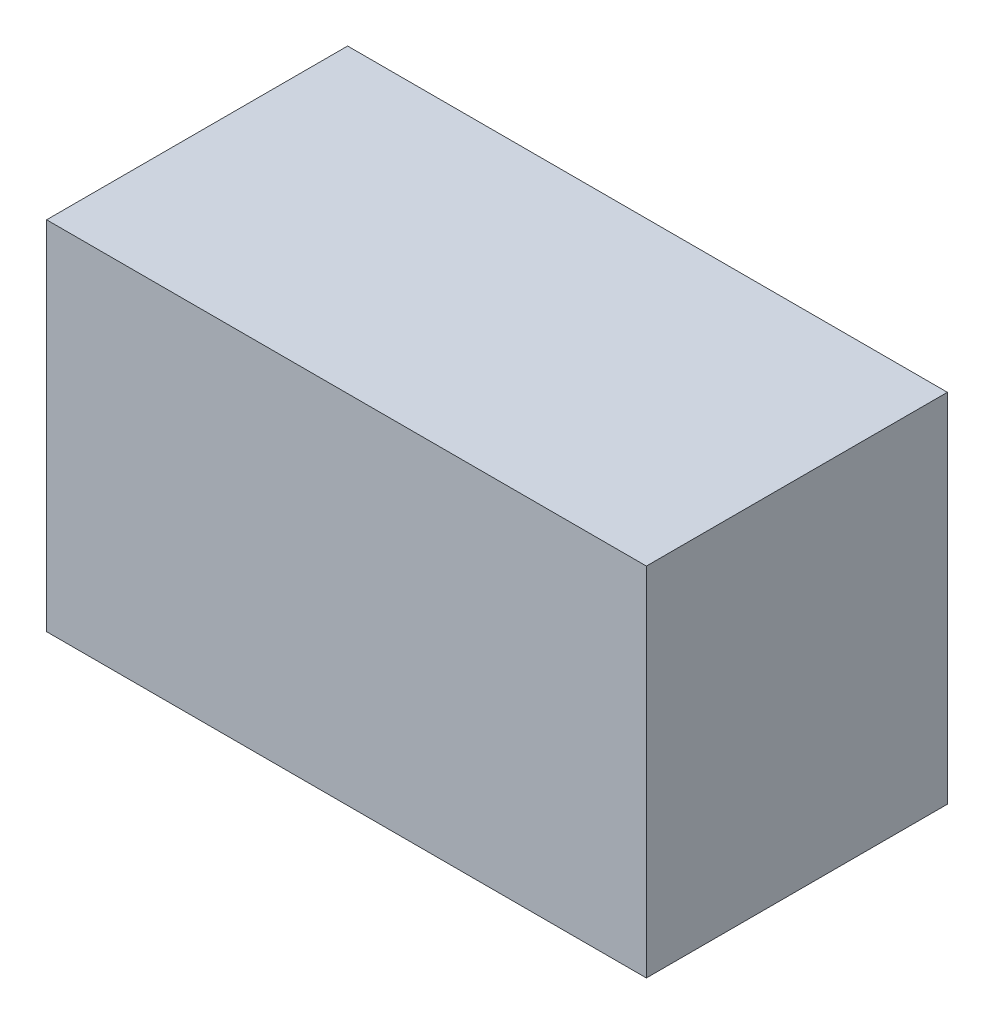
ISO-10303-21;
HEADER;
FILE_DESCRIPTION(('STEP AP214'),'2;1');
FILE_NAME('part.step','',(''),(''),'','','');
FILE_SCHEMA(('AUTOMOTIVE_DESIGN { 1 0 10303 214 1 1 1 1 }'));
ENDSEC;
DATA;
#1=APPLICATION_CONTEXT('core data for automotive mechanical design processes');
#2=APPLICATION_PROTOCOL_DEFINITION('international standard','automotive_design',2000,#1);
#3=PRODUCT_CONTEXT('',#1,'mechanical');
#4=PRODUCT('Part','Part','',(#3));
#5=PRODUCT_RELATED_PRODUCT_CATEGORY('part','',(#4));
#6=PRODUCT_DEFINITION_FORMATION('','',#4);
#7=PRODUCT_DEFINITION_CONTEXT('part definition',#1,'design');
#8=PRODUCT_DEFINITION('design','',#6,#7);
#9=PRODUCT_DEFINITION_SHAPE('','',#8);
#10=(LENGTH_UNIT() NAMED_UNIT(*) SI_UNIT(.MILLI.,.METRE.));
#11=(NAMED_UNIT(*) PLANE_ANGLE_UNIT() SI_UNIT($,.RADIAN.));
#12=(NAMED_UNIT(*) SI_UNIT($,.STERADIAN.) SOLID_ANGLE_UNIT());
#13=UNCERTAINTY_MEASURE_WITH_UNIT(LENGTH_MEASURE(1.E-05),#10,'distance_accuracy_value','');
#14=(GEOMETRIC_REPRESENTATION_CONTEXT(3) GLOBAL_UNCERTAINTY_ASSIGNED_CONTEXT((#13)) GLOBAL_UNIT_ASSIGNED_CONTEXT((#10,
#11,#12)) REPRESENTATION_CONTEXT('',''));
#15=CARTESIAN_POINT('',(0.,0.,0.));
#16=DIRECTION('',(0.,0.,1.));
#17=DIRECTION('',(1.,0.,0.));
#18=AXIS2_PLACEMENT_3D('',#15,#16,#17);
#19=CARTESIAN_POINT('',(-1.34501361991082,0.799997827418068,0.));
#20=DIRECTION('',(-1.,1.74845553146952E-07,0.));
#21=DIRECTION('',(-1.74845553146952E-07,-1.,0.));
#22=AXIS2_PLACEMENT_3D('',#19,#20,#21);
#23=PLANE('',#22);
#24=DIRECTION('',(-1.74845553109409E-07,-0.999999999999985,0.));
#25=VECTOR('',#24,1.);
#26=CARTESIAN_POINT('',(-1.34501361991082,0.799997827418068,0.));
#27=LINE('',#26,#25);
#28=CARTESIAN_POINT('',(-1.34501361991082,0.799997827418068,0.));
#29=VERTEX_POINT('',#28);
#30=CARTESIAN_POINT('',(-1.34501389966343,-0.800000646703026,0.));
#31=VERTEX_POINT('',#30);
#32=EDGE_CURVE('E11',#29,#31,#27,.T.);
#33=ORIENTED_EDGE('',*,*,#32,.T.);
#34=DIRECTION('',(0.,0.,1.));
#35=VECTOR('',#34,1.);
#36=CARTESIAN_POINT('',(-1.34501389966343,-0.800000646703026,0.));
#37=LINE('',#36,#35);
#38=CARTESIAN_POINT('',(-1.34501389966343,-0.800000646703026,1.34999978542328));
#39=VERTEX_POINT('',#38);
#40=EDGE_CURVE('E88',#31,#39,#37,.T.);
#41=ORIENTED_EDGE('',*,*,#40,.T.);
#42=DIRECTION('',(-1.74845553109409E-07,-0.999999999999985,0.));
#43=VECTOR('',#42,1.);
#44=CARTESIAN_POINT('',(-1.34501361991082,0.799997827418068,1.34999978542328));
#45=LINE('',#44,#43);
#46=CARTESIAN_POINT('',(-1.34501361991082,0.799997827418068,1.34999978542328));
#47=VERTEX_POINT('',#46);
#48=EDGE_CURVE('E83',#47,#39,#45,.T.);
#49=ORIENTED_EDGE('',*,*,#48,.F.);
#50=DIRECTION('',(0.,0.,1.));
#51=VECTOR('',#50,1.);
#52=CARTESIAN_POINT('',(-1.34501361991082,0.799997827418065,0.));
#53=LINE('',#52,#51);
#54=EDGE_CURVE('E72',#29,#47,#53,.T.);
#55=ORIENTED_EDGE('',*,*,#54,.F.);
#56=EDGE_LOOP('',(#33,#41,#49,#55));
#57=FACE_BOUND('',#56,.T.);
#58=ADVANCED_FACE('F17',(#57),#23,.T.);
#59=CARTESIAN_POINT('',(-1.34501389966343,-0.800000646703026,0.));
#60=DIRECTION('',(-1.74845553146952E-07,-1.,0.));
#61=DIRECTION('',(1.,-1.74845553146952E-07,0.));
#62=AXIS2_PLACEMENT_3D('',#59,#60,#61);
#63=PLANE('',#62);
#64=DIRECTION('',(0.999999999999985,-1.74845553157912E-07,0.));
#65=VECTOR('',#64,1.);
#66=CARTESIAN_POINT('',(-1.34501389966343,-0.800000646703026,0.));
#67=LINE('',#66,#65);
#68=CARTESIAN_POINT('',(1.34498854174282,-0.800001117037994,0.));
#69=VERTEX_POINT('',#68);
#70=EDGE_CURVE('E24',#31,#69,#67,.T.);
#71=ORIENTED_EDGE('',*,*,#70,.T.);
#72=DIRECTION('',(0.,0.,1.));
#73=VECTOR('',#72,1.);
#74=CARTESIAN_POINT('',(1.34498854174282,-0.800001117037991,0.));
#75=LINE('',#74,#73);
#76=CARTESIAN_POINT('',(1.34498854174282,-0.800001117037994,1.34999978542328));
#77=VERTEX_POINT('',#76);
#78=EDGE_CURVE('E85',#69,#77,#75,.T.);
#79=ORIENTED_EDGE('',*,*,#78,.T.);
#80=DIRECTION('',(0.999999999999985,-1.74845553157912E-07,0.));
#81=VECTOR('',#80,1.);
#82=CARTESIAN_POINT('',(-1.34501389966343,-0.800000646703026,1.34999978542328));
#83=LINE('',#82,#81);
#84=EDGE_CURVE('E66',#39,#77,#83,.T.);
#85=ORIENTED_EDGE('',*,*,#84,.F.);
#86=ORIENTED_EDGE('',*,*,#40,.F.);
#87=EDGE_LOOP('',(#71,#79,#85,#86));
#88=FACE_BOUND('',#87,.T.);
#89=ADVANCED_FACE('F89',(#88),#63,.T.);
#90=CARTESIAN_POINT('',(1.34498854174282,-0.800001117037994,0.));
#91=DIRECTION('',(1.,-1.74845553146952E-07,0.));
#92=DIRECTION('',(1.74845553146952E-07,1.,0.));
#93=AXIS2_PLACEMENT_3D('',#90,#91,#92);
#94=PLANE('',#93);
#95=DIRECTION('',(1.74845553109409E-07,0.999999999999985,0.));
#96=VECTOR('',#95,1.);
#97=CARTESIAN_POINT('',(1.34498854174282,-0.800001117037994,0.));
#98=LINE('',#97,#96);
#99=CARTESIAN_POINT('',(1.34498882149543,0.7999973570831,0.));
#100=VERTEX_POINT('',#99);
#101=EDGE_CURVE('E62',#69,#100,#98,.T.);
#102=ORIENTED_EDGE('',*,*,#101,.T.);
#103=DIRECTION('',(0.,0.,1.));
#104=VECTOR('',#103,1.);
#105=CARTESIAN_POINT('',(1.34498882149544,0.7999973570831,0.));
#106=LINE('',#105,#104);
#107=CARTESIAN_POINT('',(1.34498882149543,0.7999973570831,1.34999978542328));
#108=VERTEX_POINT('',#107);
#109=EDGE_CURVE('E55',#100,#108,#106,.T.);
#110=ORIENTED_EDGE('',*,*,#109,.T.);
#111=DIRECTION('',(1.74845553109409E-07,0.999999999999985,0.));
#112=VECTOR('',#111,1.);
#113=CARTESIAN_POINT('',(1.34498854174282,-0.800001117037994,1.34999978542328));
#114=LINE('',#113,#112);
#115=EDGE_CURVE('E59',#77,#108,#114,.T.);
#116=ORIENTED_EDGE('',*,*,#115,.F.);
#117=ORIENTED_EDGE('',*,*,#78,.F.);
#118=EDGE_LOOP('',(#102,#110,#116,#117));
#119=FACE_BOUND('',#118,.T.);
#120=ADVANCED_FACE('F57',(#119),#94,.T.);
#121=CARTESIAN_POINT('',(1.34498882149543,0.7999973570831,0.));
#122=DIRECTION('',(1.74845553146952E-07,1.,0.));
#123=DIRECTION('',(-1.,1.74845553146952E-07,0.));
#124=AXIS2_PLACEMENT_3D('',#121,#122,#123);
#125=PLANE('',#124);
#126=DIRECTION('',(-0.999999999999985,1.74845553157912E-07,0.));
#127=VECTOR('',#126,1.);
#128=CARTESIAN_POINT('',(1.34498882149543,0.7999973570831,0.));
#129=LINE('',#128,#127);
#130=EDGE_CURVE('E65',#100,#29,#129,.T.);
#131=ORIENTED_EDGE('',*,*,#130,.T.);
#132=ORIENTED_EDGE('',*,*,#54,.T.);
#133=DIRECTION('',(-0.999999999999985,1.74845553157912E-07,0.));
#134=VECTOR('',#133,1.);
#135=CARTESIAN_POINT('',(1.34498882149543,0.7999973570831,1.34999978542328));
#136=LINE('',#135,#134);
#137=EDGE_CURVE('E70',#108,#47,#136,.T.);
#138=ORIENTED_EDGE('',*,*,#137,.F.);
#139=ORIENTED_EDGE('',*,*,#109,.F.);
#140=EDGE_LOOP('',(#131,#132,#138,#139));
#141=FACE_BOUND('',#140,.T.);
#142=ADVANCED_FACE('F71',(#141),#125,.T.);
#143=CARTESIAN_POINT('',(-249.400024414063,-102.82495880127,1.34999978542328));
#144=DIRECTION('',(0.,0.,1.));
#145=DIRECTION('',(1.,-1.74845553146952E-07,0.));
#146=AXIS2_PLACEMENT_3D('',#143,#144,#145);
#147=PLANE('',#146);
#148=ORIENTED_EDGE('',*,*,#48,.T.);
#149=ORIENTED_EDGE('',*,*,#84,.T.);
#150=ORIENTED_EDGE('',*,*,#115,.T.);
#151=ORIENTED_EDGE('',*,*,#137,.T.);
#152=EDGE_LOOP('',(#148,#149,#150,#151));
#153=FACE_BOUND('',#152,.T.);
#154=ADVANCED_FACE('F76',(#153),#147,.T.);
#155=CARTESIAN_POINT('',(-249.400024414063,-102.82495880127,0.));
#156=DIRECTION('',(0.,0.,1.));
#157=DIRECTION('',(1.,-1.74845553146952E-07,0.));
#158=AXIS2_PLACEMENT_3D('',#155,#156,#157);
#159=PLANE('',#158);
#160=ORIENTED_EDGE('',*,*,#130,.F.);
#161=ORIENTED_EDGE('',*,*,#101,.F.);
#162=ORIENTED_EDGE('',*,*,#70,.F.);
#163=ORIENTED_EDGE('',*,*,#32,.F.);
#164=EDGE_LOOP('',(#160,#161,#162,#163));
#165=FACE_BOUND('',#164,.T.);
#166=ADVANCED_FACE('F91',(#165),#159,.F.);
#167=CLOSED_SHELL('',(#58,#89,#120,#142,#154,#166));
#168=MANIFOLD_SOLID_BREP('B1',#167);
#169=ADVANCED_BREP_SHAPE_REPRESENTATION('',(#18,#168),#14);
#170=SHAPE_DEFINITION_REPRESENTATION(#9,#169);
ENDSEC;
END-ISO-10303-21;
